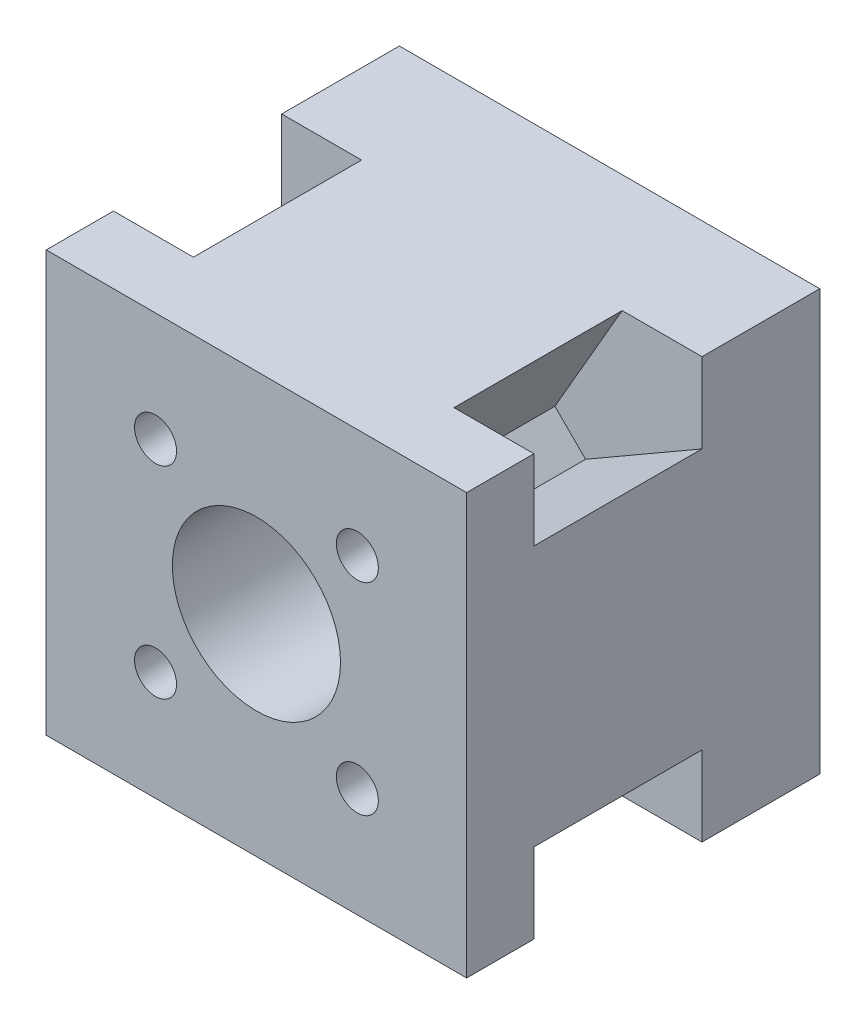
ISO-10303-21;
HEADER;
FILE_DESCRIPTION(('STEP AP214'),'2;1');
FILE_NAME('part.step','',(''),(''),'','','');
FILE_SCHEMA(('AUTOMOTIVE_DESIGN { 1 0 10303 214 1 1 1 1 }'));
ENDSEC;
DATA;
#1=APPLICATION_CONTEXT('core data for automotive mechanical design processes');
#2=APPLICATION_PROTOCOL_DEFINITION('international standard','automotive_design',2000,#1);
#3=PRODUCT_CONTEXT('',#1,'mechanical');
#4=PRODUCT('Part','Part','',(#3));
#5=PRODUCT_RELATED_PRODUCT_CATEGORY('part','',(#4));
#6=PRODUCT_DEFINITION_FORMATION('','',#4);
#7=PRODUCT_DEFINITION_CONTEXT('part definition',#1,'design');
#8=PRODUCT_DEFINITION('design','',#6,#7);
#9=PRODUCT_DEFINITION_SHAPE('','',#8);
#10=(LENGTH_UNIT() NAMED_UNIT(*) SI_UNIT(.MILLI.,.METRE.));
#11=(NAMED_UNIT(*) PLANE_ANGLE_UNIT() SI_UNIT($,.RADIAN.));
#12=(NAMED_UNIT(*) SI_UNIT($,.STERADIAN.) SOLID_ANGLE_UNIT());
#13=UNCERTAINTY_MEASURE_WITH_UNIT(LENGTH_MEASURE(1.E-05),#10,'distance_accuracy_value','');
#14=(GEOMETRIC_REPRESENTATION_CONTEXT(3) GLOBAL_UNCERTAINTY_ASSIGNED_CONTEXT((#13)) GLOBAL_UNIT_ASSIGNED_CONTEXT((#10,
#11,#12)) REPRESENTATION_CONTEXT('',''));
#15=CARTESIAN_POINT('',(0.,0.,0.));
#16=DIRECTION('',(0.,0.,1.));
#17=DIRECTION('',(1.,0.,0.));
#18=AXIS2_PLACEMENT_3D('',#15,#16,#17);
#19=CARTESIAN_POINT('',(0.,0.,14.));
#20=DIRECTION('',(0.,0.,1.));
#21=DIRECTION('',(1.,0.,0.));
#22=AXIS2_PLACEMENT_3D('',#19,#20,#21);
#23=PLANE('',#22);
#24=DIRECTION('',(0.500000000000004,0.866025403784436,0.));
#25=VECTOR('',#24,1.);
#26=CARTESIAN_POINT('',(7.49999999999993,11.143593539449,14.));
#27=LINE('',#26,#25);
#28=CARTESIAN_POINT('',(7.49999999999993,11.143593539449,14.));
#29=VERTEX_POINT('',#28);
#30=CARTESIAN_POINT('',(15.5,25.,14.));
#31=VERTEX_POINT('',#30);
#32=EDGE_CURVE('E51',#29,#31,#27,.T.);
#33=ORIENTED_EDGE('',*,*,#32,.F.);
#34=DIRECTION('',(-0.707106781186547,0.707106781186548,0.));
#35=VECTOR('',#34,1.);
#36=CARTESIAN_POINT('',(7.49999999999993,11.143593539449,14.));
#37=LINE('',#36,#35);
#38=CARTESIAN_POINT('',(11.143593539449,7.49999999999994,14.));
#39=VERTEX_POINT('',#38);
#40=EDGE_CURVE('E55',#39,#29,#37,.T.);
#41=ORIENTED_EDGE('',*,*,#40,.F.);
#42=DIRECTION('',(-0.866025403784436,-0.500000000000004,0.));
#43=VECTOR('',#42,1.);
#44=CARTESIAN_POINT('',(25.,15.5,14.));
#45=LINE('',#44,#43);
#46=CARTESIAN_POINT('',(25.,15.5,14.));
#47=VERTEX_POINT('',#46);
#48=EDGE_CURVE('E290',#47,#39,#45,.T.);
#49=ORIENTED_EDGE('',*,*,#48,.F.);
#50=DIRECTION('',(0.,-1.,0.));
#51=VECTOR('',#50,1.);
#52=CARTESIAN_POINT('',(25.,0.,14.));
#53=LINE('',#52,#51);
#54=CARTESIAN_POINT('',(25.,25.,14.));
#55=VERTEX_POINT('',#54);
#56=EDGE_CURVE('E366',#55,#47,#53,.T.);
#57=ORIENTED_EDGE('',*,*,#56,.F.);
#58=DIRECTION('',(1.,0.,0.));
#59=VECTOR('',#58,1.);
#60=CARTESIAN_POINT('',(0.,25.,14.));
#61=LINE('',#60,#59);
#62=EDGE_CURVE('E369',#31,#55,#61,.T.);
#63=ORIENTED_EDGE('',*,*,#62,.F.);
#64=EDGE_LOOP('',(#33,#41,#49,#57,#63));
#65=FACE_BOUND('',#64,.T.);
#66=ADVANCED_FACE('F36',(#65),#23,.T.);
#67=DIRECTION('',(0.866025403784439,-0.5,0.));
#68=VECTOR('',#67,1.);
#69=CARTESIAN_POINT('',(11.143593539449,-7.49999999999999,14.));
#70=LINE('',#69,#68);
#71=CARTESIAN_POINT('',(11.143593539449,-7.49999999999999,14.));
#72=VERTEX_POINT('',#71);
#73=CARTESIAN_POINT('',(25.,-15.5,14.));
#74=VERTEX_POINT('',#73);
#75=EDGE_CURVE('E287',#72,#74,#70,.T.);
#76=ORIENTED_EDGE('',*,*,#75,.F.);
#77=DIRECTION('',(0.70710678118655,0.707106781186545,0.));
#78=VECTOR('',#77,1.);
#79=CARTESIAN_POINT('',(7.49999999999993,-11.143593539449,14.));
#80=LINE('',#79,#78);
#81=CARTESIAN_POINT('',(7.49999999999993,-11.143593539449,14.));
#82=VERTEX_POINT('',#81);
#83=EDGE_CURVE('E284',#82,#72,#80,.T.);
#84=ORIENTED_EDGE('',*,*,#83,.F.);
#85=DIRECTION('',(-0.500000000000004,0.866025403784436,0.));
#86=VECTOR('',#85,1.);
#87=CARTESIAN_POINT('',(15.5,-25.,14.));
#88=LINE('',#87,#86);
#89=CARTESIAN_POINT('',(15.5,-25.,14.));
#90=VERTEX_POINT('',#89);
#91=EDGE_CURVE('E281',#90,#82,#88,.T.);
#92=ORIENTED_EDGE('',*,*,#91,.F.);
#93=DIRECTION('',(1.,0.,0.));
#94=VECTOR('',#93,1.);
#95=CARTESIAN_POINT('',(0.,-25.,14.));
#96=LINE('',#95,#94);
#97=CARTESIAN_POINT('',(25.,-25.,14.));
#98=VERTEX_POINT('',#97);
#99=EDGE_CURVE('E377',#90,#98,#96,.T.);
#100=ORIENTED_EDGE('',*,*,#99,.T.);
#101=EDGE_CURVE('E370',#74,#98,#53,.T.);
#102=ORIENTED_EDGE('',*,*,#101,.F.);
#103=EDGE_LOOP('',(#76,#84,#92,#100,#102));
#104=FACE_BOUND('',#103,.T.);
#105=ADVANCED_FACE('F513',(#104),#23,.T.);
#106=DIRECTION('',(-0.499999999999998,-0.86602540378444,0.));
#107=VECTOR('',#106,1.);
#108=CARTESIAN_POINT('',(-15.5,-25.,14.));
#109=LINE('',#108,#107);
#110=CARTESIAN_POINT('',(-7.50000000000004,-11.143593539449,14.));
#111=VERTEX_POINT('',#110);
#112=CARTESIAN_POINT('',(-15.5,-25.,14.));
#113=VERTEX_POINT('',#112);
#114=EDGE_CURVE('E278',#111,#113,#109,.T.);
#115=ORIENTED_EDGE('',*,*,#114,.F.);
#116=DIRECTION('',(0.707106781186544,-0.707106781186551,0.));
#117=VECTOR('',#116,1.);
#118=CARTESIAN_POINT('',(-11.143593539449,-7.49999999999993,14.));
#119=LINE('',#118,#117);
#120=CARTESIAN_POINT('',(-11.143593539449,-7.49999999999993,14.));
#121=VERTEX_POINT('',#120);
#122=EDGE_CURVE('E275',#121,#111,#119,.T.);
#123=ORIENTED_EDGE('',*,*,#122,.F.);
#124=DIRECTION('',(0.866025403784436,0.500000000000004,0.));
#125=VECTOR('',#124,1.);
#126=CARTESIAN_POINT('',(-25.,-15.5,14.));
#127=LINE('',#126,#125);
#128=CARTESIAN_POINT('',(-25.,-15.5,14.));
#129=VERTEX_POINT('',#128);
#130=EDGE_CURVE('E272',#129,#121,#127,.T.);
#131=ORIENTED_EDGE('',*,*,#130,.F.);
#132=DIRECTION('',(0.,-1.,0.));
#133=VECTOR('',#132,1.);
#134=CARTESIAN_POINT('',(-25.,0.,14.));
#135=LINE('',#134,#133);
#136=CARTESIAN_POINT('',(-25.,-25.,14.));
#137=VERTEX_POINT('',#136);
#138=EDGE_CURVE('E374',#129,#137,#135,.T.);
#139=ORIENTED_EDGE('',*,*,#138,.T.);
#140=EDGE_CURVE('E378',#137,#113,#96,.T.);
#141=ORIENTED_EDGE('',*,*,#140,.T.);
#142=EDGE_LOOP('',(#115,#123,#131,#139,#141));
#143=FACE_BOUND('',#142,.T.);
#144=ADVANCED_FACE('F515',(#143),#23,.T.);
#145=CARTESIAN_POINT('',(25.,0.,14.));
#146=DIRECTION('',(1.,0.,0.));
#147=DIRECTION('',(0.,1.,0.));
#148=AXIS2_PLACEMENT_3D('',#145,#146,#147);
#149=PLANE('',#148);
#150=DIRECTION('',(0.,-1.,0.));
#151=VECTOR('',#150,1.);
#152=CARTESIAN_POINT('',(25.,0.,0.));
#153=LINE('',#152,#151);
#154=CARTESIAN_POINT('',(25.,25.,0.));
#155=VERTEX_POINT('',#154);
#156=CARTESIAN_POINT('',(25.,-25.,0.));
#157=VERTEX_POINT('',#156);
#158=EDGE_CURVE('E363',#155,#157,#153,.T.);
#159=ORIENTED_EDGE('',*,*,#158,.F.);
#160=DIRECTION('',(0.,0.,-1.));
#161=VECTOR('',#160,1.);
#162=CARTESIAN_POINT('',(25.,25.,14.));
#163=LINE('',#162,#161);
#164=EDGE_CURVE('E11',#55,#155,#163,.T.);
#165=ORIENTED_EDGE('',*,*,#164,.F.);
#166=ORIENTED_EDGE('',*,*,#56,.T.);
#167=DIRECTION('',(0.,0.,-1.));
#168=VECTOR('',#167,1.);
#169=CARTESIAN_POINT('',(25.,15.5,34.));
#170=LINE('',#169,#168);
#171=CARTESIAN_POINT('',(25.,15.5,34.));
#172=VERTEX_POINT('',#171);
#173=EDGE_CURVE('E305',#172,#47,#170,.T.);
#174=ORIENTED_EDGE('',*,*,#173,.F.);
#175=DIRECTION('',(0.,1.,0.));
#176=VECTOR('',#175,1.);
#177=CARTESIAN_POINT('',(25.,25.,34.));
#178=LINE('',#177,#176);
#179=CARTESIAN_POINT('',(25.,25.,34.));
#180=VERTEX_POINT('',#179);
#181=EDGE_CURVE('E219',#172,#180,#178,.T.);
#182=ORIENTED_EDGE('',*,*,#181,.T.);
#183=DIRECTION('',(0.,0.,-1.));
#184=VECTOR('',#183,1.);
#185=CARTESIAN_POINT('',(25.,25.,42.));
#186=LINE('',#185,#184);
#187=CARTESIAN_POINT('',(25.,25.,42.));
#188=VERTEX_POINT('',#187);
#189=EDGE_CURVE('E200',#188,#180,#186,.T.);
#190=ORIENTED_EDGE('',*,*,#189,.F.);
#191=DIRECTION('',(0.,1.,0.));
#192=VECTOR('',#191,1.);
#193=CARTESIAN_POINT('',(25.,25.,42.));
#194=LINE('',#193,#192);
#195=CARTESIAN_POINT('',(25.,-25.,42.));
#196=VERTEX_POINT('',#195);
#197=EDGE_CURVE('E206',#196,#188,#194,.T.);
#198=ORIENTED_EDGE('',*,*,#197,.F.);
#199=DIRECTION('',(0.,0.,-1.));
#200=VECTOR('',#199,1.);
#201=CARTESIAN_POINT('',(25.,-25.,42.));
#202=LINE('',#201,#200);
#203=CARTESIAN_POINT('',(25.,-25.,34.));
#204=VERTEX_POINT('',#203);
#205=EDGE_CURVE('E435',#196,#204,#202,.T.);
#206=ORIENTED_EDGE('',*,*,#205,.T.);
#207=CARTESIAN_POINT('',(25.,-15.5,34.));
#208=VERTEX_POINT('',#207);
#209=EDGE_CURVE('E439',#204,#208,#178,.T.);
#210=ORIENTED_EDGE('',*,*,#209,.T.);
#211=DIRECTION('',(0.,0.,-1.));
#212=VECTOR('',#211,1.);
#213=CARTESIAN_POINT('',(25.,-15.5,34.));
#214=LINE('',#213,#212);
#215=EDGE_CURVE('E308',#208,#74,#214,.T.);
#216=ORIENTED_EDGE('',*,*,#215,.T.);
#217=ORIENTED_EDGE('',*,*,#101,.T.);
#218=DIRECTION('',(0.,0.,-1.));
#219=VECTOR('',#218,1.);
#220=CARTESIAN_POINT('',(25.,-25.,14.));
#221=LINE('',#220,#219);
#222=EDGE_CURVE('E380',#98,#157,#221,.T.);
#223=ORIENTED_EDGE('',*,*,#222,.T.);
#224=EDGE_LOOP('',(#159,#165,#166,#174,#182,#190,#198,#206,#210,#216,#217,#223));
#225=FACE_BOUND('',#224,.T.);
#226=ADVANCED_FACE('F38',(#225),#149,.T.);
#227=CARTESIAN_POINT('',(0.,25.,14.));
#228=DIRECTION('',(0.,1.,0.));
#229=DIRECTION('',(0.,0.,1.));
#230=AXIS2_PLACEMENT_3D('',#227,#228,#229);
#231=PLANE('',#230);
#232=DIRECTION('',(1.,0.,0.));
#233=VECTOR('',#232,1.);
#234=CARTESIAN_POINT('',(0.,25.,0.));
#235=LINE('',#234,#233);
#236=CARTESIAN_POINT('',(-25.,25.,0.));
#237=VERTEX_POINT('',#236);
#238=EDGE_CURVE('E383',#237,#155,#235,.T.);
#239=ORIENTED_EDGE('',*,*,#238,.F.);
#240=DIRECTION('',(0.,0.,-1.));
#241=VECTOR('',#240,1.);
#242=CARTESIAN_POINT('',(-25.,25.,14.));
#243=LINE('',#242,#241);
#244=CARTESIAN_POINT('',(-25.,25.,14.));
#245=VERTEX_POINT('',#244);
#246=EDGE_CURVE('E44',#245,#237,#243,.T.);
#247=ORIENTED_EDGE('',*,*,#246,.F.);
#248=CARTESIAN_POINT('',(-15.5,25.,14.));
#249=VERTEX_POINT('',#248);
#250=EDGE_CURVE('E371',#245,#249,#61,.T.);
#251=ORIENTED_EDGE('',*,*,#250,.T.);
#252=DIRECTION('',(0.,0.,-1.));
#253=VECTOR('',#252,1.);
#254=CARTESIAN_POINT('',(-15.5,25.,34.));
#255=LINE('',#254,#253);
#256=CARTESIAN_POINT('',(-15.5,25.,34.));
#257=VERTEX_POINT('',#256);
#258=EDGE_CURVE('E265',#257,#249,#255,.T.);
#259=ORIENTED_EDGE('',*,*,#258,.F.);
#260=DIRECTION('',(-1.,0.,0.));
#261=VECTOR('',#260,1.);
#262=CARTESIAN_POINT('',(-25.,25.,34.));
#263=LINE('',#262,#261);
#264=CARTESIAN_POINT('',(-25.,25.,34.));
#265=VERTEX_POINT('',#264);
#266=EDGE_CURVE('E430',#257,#265,#263,.T.);
#267=ORIENTED_EDGE('',*,*,#266,.T.);
#268=DIRECTION('',(0.,0.,-1.));
#269=VECTOR('',#268,1.);
#270=CARTESIAN_POINT('',(-25.,25.,42.));
#271=LINE('',#270,#269);
#272=CARTESIAN_POINT('',(-25.,25.,42.));
#273=VERTEX_POINT('',#272);
#274=EDGE_CURVE('E202',#273,#265,#271,.T.);
#275=ORIENTED_EDGE('',*,*,#274,.F.);
#276=DIRECTION('',(-1.,0.,0.));
#277=VECTOR('',#276,1.);
#278=CARTESIAN_POINT('',(-25.,25.,42.));
#279=LINE('',#278,#277);
#280=EDGE_CURVE('E194',#188,#273,#279,.T.);
#281=ORIENTED_EDGE('',*,*,#280,.F.);
#282=ORIENTED_EDGE('',*,*,#189,.T.);
#283=CARTESIAN_POINT('',(15.5,25.,34.));
#284=VERTEX_POINT('',#283);
#285=EDGE_CURVE('E426',#180,#284,#263,.T.);
#286=ORIENTED_EDGE('',*,*,#285,.T.);
#287=DIRECTION('',(0.,0.,-1.));
#288=VECTOR('',#287,1.);
#289=CARTESIAN_POINT('',(15.5,25.,34.));
#290=LINE('',#289,#288);
#291=EDGE_CURVE('E296',#284,#31,#290,.T.);
#292=ORIENTED_EDGE('',*,*,#291,.T.);
#293=ORIENTED_EDGE('',*,*,#62,.T.);
#294=ORIENTED_EDGE('',*,*,#164,.T.);
#295=EDGE_LOOP('',(#239,#247,#251,#259,#267,#275,#281,#282,#286,#292,#293,#294));
#296=FACE_BOUND('',#295,.T.);
#297=ADVANCED_FACE('F197',(#296),#231,.T.);
#298=CARTESIAN_POINT('',(-25.,0.,14.));
#299=DIRECTION('',(1.,0.,0.));
#300=DIRECTION('',(0.,1.,0.));
#301=AXIS2_PLACEMENT_3D('',#298,#299,#300);
#302=PLANE('',#301);
#303=DIRECTION('',(0.,-1.,0.));
#304=VECTOR('',#303,1.);
#305=CARTESIAN_POINT('',(-25.,0.,0.));
#306=LINE('',#305,#304);
#307=CARTESIAN_POINT('',(-25.,-25.,0.));
#308=VERTEX_POINT('',#307);
#309=EDGE_CURVE('E386',#237,#308,#306,.T.);
#310=ORIENTED_EDGE('',*,*,#309,.T.);
#311=DIRECTION('',(0.,0.,-1.));
#312=VECTOR('',#311,1.);
#313=CARTESIAN_POINT('',(-25.,-25.,14.));
#314=LINE('',#313,#312);
#315=EDGE_CURVE('E392',#137,#308,#314,.T.);
#316=ORIENTED_EDGE('',*,*,#315,.F.);
#317=ORIENTED_EDGE('',*,*,#138,.F.);
#318=DIRECTION('',(0.,0.,-1.));
#319=VECTOR('',#318,1.);
#320=CARTESIAN_POINT('',(-25.,-15.5,34.));
#321=LINE('',#320,#319);
#322=CARTESIAN_POINT('',(-25.,-15.5,34.));
#323=VERTEX_POINT('',#322);
#324=EDGE_CURVE('E329',#323,#129,#321,.T.);
#325=ORIENTED_EDGE('',*,*,#324,.F.);
#326=DIRECTION('',(0.,-1.,0.));
#327=VECTOR('',#326,1.);
#328=CARTESIAN_POINT('',(-25.,25.,34.));
#329=LINE('',#328,#327);
#330=CARTESIAN_POINT('',(-25.,-25.,34.));
#331=VERTEX_POINT('',#330);
#332=EDGE_CURVE('E420',#323,#331,#329,.T.);
#333=ORIENTED_EDGE('',*,*,#332,.T.);
#334=DIRECTION('',(0.,0.,-1.));
#335=VECTOR('',#334,1.);
#336=CARTESIAN_POINT('',(-25.,-25.,42.));
#337=LINE('',#336,#335);
#338=CARTESIAN_POINT('',(-25.,-25.,42.));
#339=VERTEX_POINT('',#338);
#340=EDGE_CURVE('E226',#339,#331,#337,.T.);
#341=ORIENTED_EDGE('',*,*,#340,.F.);
#342=DIRECTION('',(0.,-1.,0.));
#343=VECTOR('',#342,1.);
#344=CARTESIAN_POINT('',(-25.,25.,42.));
#345=LINE('',#344,#343);
#346=EDGE_CURVE('E205',#273,#339,#345,.T.);
#347=ORIENTED_EDGE('',*,*,#346,.F.);
#348=ORIENTED_EDGE('',*,*,#274,.T.);
#349=CARTESIAN_POINT('',(-25.,15.5,34.));
#350=VERTEX_POINT('',#349);
#351=EDGE_CURVE('E425',#265,#350,#329,.T.);
#352=ORIENTED_EDGE('',*,*,#351,.T.);
#353=DIRECTION('',(0.,0.,-1.));
#354=VECTOR('',#353,1.);
#355=CARTESIAN_POINT('',(-25.,15.5,34.));
#356=LINE('',#355,#354);
#357=CARTESIAN_POINT('',(-25.,15.5,14.));
#358=VERTEX_POINT('',#357);
#359=EDGE_CURVE('E332',#350,#358,#356,.T.);
#360=ORIENTED_EDGE('',*,*,#359,.T.);
#361=EDGE_CURVE('E375',#245,#358,#135,.T.);
#362=ORIENTED_EDGE('',*,*,#361,.F.);
#363=ORIENTED_EDGE('',*,*,#246,.T.);
#364=EDGE_LOOP('',(#310,#316,#317,#325,#333,#341,#347,#348,#352,#360,#362,#363));
#365=FACE_BOUND('',#364,.T.);
#366=ADVANCED_FACE('F397',(#365),#302,.F.);
#367=CARTESIAN_POINT('',(0.,-25.,14.));
#368=DIRECTION('',(0.,1.,0.));
#369=DIRECTION('',(0.,0.,1.));
#370=AXIS2_PLACEMENT_3D('',#367,#368,#369);
#371=PLANE('',#370);
#372=DIRECTION('',(1.,0.,0.));
#373=VECTOR('',#372,1.);
#374=CARTESIAN_POINT('',(0.,-25.,0.));
#375=LINE('',#374,#373);
#376=EDGE_CURVE('E388',#308,#157,#375,.T.);
#377=ORIENTED_EDGE('',*,*,#376,.T.);
#378=ORIENTED_EDGE('',*,*,#222,.F.);
#379=ORIENTED_EDGE('',*,*,#99,.F.);
#380=DIRECTION('',(0.,0.,-1.));
#381=VECTOR('',#380,1.);
#382=CARTESIAN_POINT('',(15.5,-25.,34.));
#383=LINE('',#382,#381);
#384=CARTESIAN_POINT('',(15.5,-25.,34.));
#385=VERTEX_POINT('',#384);
#386=EDGE_CURVE('E317',#385,#90,#383,.T.);
#387=ORIENTED_EDGE('',*,*,#386,.F.);
#388=DIRECTION('',(1.,0.,0.));
#389=VECTOR('',#388,1.);
#390=CARTESIAN_POINT('',(-25.,-25.,34.));
#391=LINE('',#390,#389);
#392=EDGE_CURVE('E429',#385,#204,#391,.T.);
#393=ORIENTED_EDGE('',*,*,#392,.T.);
#394=ORIENTED_EDGE('',*,*,#205,.F.);
#395=DIRECTION('',(1.,0.,0.));
#396=VECTOR('',#395,1.);
#397=CARTESIAN_POINT('',(-25.,-25.,42.));
#398=LINE('',#397,#396);
#399=EDGE_CURVE('E211',#339,#196,#398,.T.);
#400=ORIENTED_EDGE('',*,*,#399,.F.);
#401=ORIENTED_EDGE('',*,*,#340,.T.);
#402=CARTESIAN_POINT('',(-15.5,-25.,34.));
#403=VERTEX_POINT('',#402);
#404=EDGE_CURVE('E215',#331,#403,#391,.T.);
#405=ORIENTED_EDGE('',*,*,#404,.T.);
#406=DIRECTION('',(0.,0.,-1.));
#407=VECTOR('',#406,1.);
#408=CARTESIAN_POINT('',(-15.5,-25.,34.));
#409=LINE('',#408,#407);
#410=EDGE_CURVE('E320',#403,#113,#409,.T.);
#411=ORIENTED_EDGE('',*,*,#410,.T.);
#412=ORIENTED_EDGE('',*,*,#140,.F.);
#413=ORIENTED_EDGE('',*,*,#315,.T.);
#414=EDGE_LOOP('',(#377,#378,#379,#387,#393,#394,#400,#401,#405,#411,#412,#413));
#415=FACE_BOUND('',#414,.T.);
#416=ADVANCED_FACE('F409',(#415),#371,.F.);
#417=DIRECTION('',(0.500000000000004,-0.866025403784436,0.));
#418=VECTOR('',#417,1.);
#419=CARTESIAN_POINT('',(-15.5,25.,14.));
#420=LINE('',#419,#418);
#421=CARTESIAN_POINT('',(-7.49999999999994,11.143593539449,14.));
#422=VERTEX_POINT('',#421);
#423=EDGE_CURVE('E221',#249,#422,#420,.T.);
#424=ORIENTED_EDGE('',*,*,#423,.F.);
#425=ORIENTED_EDGE('',*,*,#250,.F.);
#426=ORIENTED_EDGE('',*,*,#361,.T.);
#427=DIRECTION('',(-0.866025403784436,0.500000000000004,0.));
#428=VECTOR('',#427,1.);
#429=CARTESIAN_POINT('',(-11.143593539449,7.49999999999994,14.));
#430=LINE('',#429,#428);
#431=CARTESIAN_POINT('',(-11.143593539449,7.49999999999994,14.));
#432=VERTEX_POINT('',#431);
#433=EDGE_CURVE('E269',#432,#358,#430,.T.);
#434=ORIENTED_EDGE('',*,*,#433,.F.);
#435=DIRECTION('',(-0.707106781186548,-0.707106781186547,0.));
#436=VECTOR('',#435,1.);
#437=CARTESIAN_POINT('',(-7.49999999999994,11.143593539449,14.));
#438=LINE('',#437,#436);
#439=EDGE_CURVE('E224',#422,#432,#438,.T.);
#440=ORIENTED_EDGE('',*,*,#439,.F.);
#441=EDGE_LOOP('',(#424,#425,#426,#434,#440));
#442=FACE_BOUND('',#441,.T.);
#443=ADVANCED_FACE('F521',(#442),#23,.T.);
#444=CARTESIAN_POINT('',(0.,0.,0.));
#445=DIRECTION('',(0.,0.,1.));
#446=DIRECTION('',(1.,0.,0.));
#447=AXIS2_PLACEMENT_3D('',#444,#445,#446);
#448=PLANE('',#447);
#449=CARTESIAN_POINT('',(0.,0.,0.));
#450=DIRECTION('',(0.,0.,1.));
#451=DIRECTION('',(1.,0.,0.));
#452=AXIS2_PLACEMENT_3D('',#449,#450,#451);
#453=CIRCLE('',#452,9.99999999999999);
#454=CARTESIAN_POINT('',(9.99999999999999,0.,0.));
#455=VERTEX_POINT('',#454);
#456=EDGE_CURVE('E459',#455,#455,#453,.F.);
#457=ORIENTED_EDGE('',*,*,#456,.F.);
#458=EDGE_LOOP('',(#457));
#459=FACE_BOUND('',#458,.T.);
#460=CARTESIAN_POINT('',(16.5,-16.5,0.));
#461=DIRECTION('',(0.,0.,-1.));
#462=DIRECTION('',(-1.,0.,0.));
#463=AXIS2_PLACEMENT_3D('',#460,#461,#462);
#464=CIRCLE('',#463,2.75);
#465=CARTESIAN_POINT('',(13.75,-16.5,0.));
#466=VERTEX_POINT('',#465);
#467=EDGE_CURVE('E341',#466,#466,#464,.T.);
#468=ORIENTED_EDGE('',*,*,#467,.F.);
#469=EDGE_LOOP('',(#468));
#470=FACE_BOUND('',#469,.T.);
#471=CARTESIAN_POINT('',(-16.5,-16.5,0.));
#472=DIRECTION('',(0.,0.,-1.));
#473=DIRECTION('',(-1.,0.,0.));
#474=AXIS2_PLACEMENT_3D('',#471,#472,#473);
#475=CIRCLE('',#474,2.75);
#476=CARTESIAN_POINT('',(-19.25,-16.5,0.));
#477=VERTEX_POINT('',#476);
#478=EDGE_CURVE('E352',#477,#477,#475,.T.);
#479=ORIENTED_EDGE('',*,*,#478,.F.);
#480=EDGE_LOOP('',(#479));
#481=FACE_BOUND('',#480,.T.);
#482=CARTESIAN_POINT('',(-16.5,16.5,0.));
#483=DIRECTION('',(0.,0.,-1.));
#484=DIRECTION('',(-1.,0.,0.));
#485=AXIS2_PLACEMENT_3D('',#482,#483,#484);
#486=CIRCLE('',#485,2.75);
#487=CARTESIAN_POINT('',(-19.25,16.5,0.));
#488=VERTEX_POINT('',#487);
#489=EDGE_CURVE('E346',#488,#488,#486,.T.);
#490=ORIENTED_EDGE('',*,*,#489,.F.);
#491=EDGE_LOOP('',(#490));
#492=FACE_BOUND('',#491,.T.);
#493=CARTESIAN_POINT('',(16.5,16.5,0.));
#494=DIRECTION('',(0.,0.,-1.));
#495=DIRECTION('',(-1.,0.,0.));
#496=AXIS2_PLACEMENT_3D('',#493,#494,#495);
#497=CIRCLE('',#496,2.75);
#498=CARTESIAN_POINT('',(13.75,16.5,0.));
#499=VERTEX_POINT('',#498);
#500=EDGE_CURVE('E345',#499,#499,#497,.T.);
#501=ORIENTED_EDGE('',*,*,#500,.F.);
#502=EDGE_LOOP('',(#501));
#503=FACE_BOUND('',#502,.T.);
#504=ORIENTED_EDGE('',*,*,#158,.T.);
#505=ORIENTED_EDGE('',*,*,#376,.F.);
#506=ORIENTED_EDGE('',*,*,#309,.F.);
#507=ORIENTED_EDGE('',*,*,#238,.T.);
#508=EDGE_LOOP('',(#504,#505,#506,#507));
#509=FACE_BOUND('',#508,.T.);
#510=ADVANCED_FACE('F402',(#459,#470,#481,#492,#503,#509),#448,.F.);
#511=CARTESIAN_POINT('',(16.5,16.5,12.));
#512=DIRECTION('',(0.,0.,-1.));
#513=DIRECTION('',(-1.,0.,0.));
#514=AXIS2_PLACEMENT_3D('',#511,#512,#513);
#515=CYLINDRICAL_SURFACE('',#514,2.75);
#516=CARTESIAN_POINT('',(16.5,16.5,12.));
#517=DIRECTION('',(0.,0.,-1.));
#518=DIRECTION('',(-1.,0.,0.));
#519=AXIS2_PLACEMENT_3D('',#516,#517,#518);
#520=CIRCLE('',#519,2.75);
#521=CARTESIAN_POINT('',(13.75,16.5,12.));
#522=VERTEX_POINT('',#521);
#523=EDGE_CURVE('E360',#522,#522,#520,.T.);
#524=ORIENTED_EDGE('',*,*,#523,.F.);
#525=EDGE_LOOP('',(#524));
#526=FACE_BOUND('',#525,.T.);
#527=ORIENTED_EDGE('',*,*,#500,.T.);
#528=EDGE_LOOP('',(#527));
#529=FACE_BOUND('',#528,.T.);
#530=ADVANCED_FACE('F526',(#526,#529),#515,.F.);
#531=CARTESIAN_POINT('',(16.5,16.5,12.));
#532=DIRECTION('',(0.,0.,-1.));
#533=DIRECTION('',(-1.,0.,0.));
#534=AXIS2_PLACEMENT_3D('',#531,#532,#533);
#535=PLANE('',#534);
#536=ORIENTED_EDGE('',*,*,#523,.T.);
#537=EDGE_LOOP('',(#536));
#538=FACE_BOUND('',#537,.T.);
#539=ADVANCED_FACE('F571',(#538),#535,.T.);
#540=CARTESIAN_POINT('',(-16.5,16.5,12.));
#541=DIRECTION('',(0.,0.,-1.));
#542=DIRECTION('',(-1.,0.,0.));
#543=AXIS2_PLACEMENT_3D('',#540,#541,#542);
#544=CYLINDRICAL_SURFACE('',#543,2.75);
#545=CARTESIAN_POINT('',(-16.5,16.5,12.));
#546=DIRECTION('',(0.,0.,-1.));
#547=DIRECTION('',(-1.,0.,0.));
#548=AXIS2_PLACEMENT_3D('',#545,#546,#547);
#549=CIRCLE('',#548,2.75);
#550=CARTESIAN_POINT('',(-19.25,16.5,12.));
#551=VERTEX_POINT('',#550);
#552=EDGE_CURVE('E342',#551,#551,#549,.T.);
#553=ORIENTED_EDGE('',*,*,#552,.F.);
#554=EDGE_LOOP('',(#553));
#555=FACE_BOUND('',#554,.T.);
#556=ORIENTED_EDGE('',*,*,#489,.T.);
#557=EDGE_LOOP('',(#556));
#558=FACE_BOUND('',#557,.T.);
#559=ADVANCED_FACE('F578',(#555,#558),#544,.F.);
#560=CARTESIAN_POINT('',(-16.5,16.5,12.));
#561=DIRECTION('',(0.,0.,-1.));
#562=DIRECTION('',(-1.,0.,0.));
#563=AXIS2_PLACEMENT_3D('',#560,#561,#562);
#564=PLANE('',#563);
#565=ORIENTED_EDGE('',*,*,#552,.T.);
#566=EDGE_LOOP('',(#565));
#567=FACE_BOUND('',#566,.T.);
#568=ADVANCED_FACE('F585',(#567),#564,.T.);
#569=CARTESIAN_POINT('',(-16.5,-16.5,12.));
#570=DIRECTION('',(0.,0.,-1.));
#571=DIRECTION('',(-1.,0.,0.));
#572=AXIS2_PLACEMENT_3D('',#569,#570,#571);
#573=CYLINDRICAL_SURFACE('',#572,2.75);
#574=CARTESIAN_POINT('',(-16.5,-16.5,12.));
#575=DIRECTION('',(0.,0.,-1.));
#576=DIRECTION('',(-1.,0.,0.));
#577=AXIS2_PLACEMENT_3D('',#574,#575,#576);
#578=CIRCLE('',#577,2.75);
#579=CARTESIAN_POINT('',(-19.25,-16.5,12.));
#580=VERTEX_POINT('',#579);
#581=EDGE_CURVE('E349',#580,#580,#578,.T.);
#582=ORIENTED_EDGE('',*,*,#581,.F.);
#583=EDGE_LOOP('',(#582));
#584=FACE_BOUND('',#583,.T.);
#585=ORIENTED_EDGE('',*,*,#478,.T.);
#586=EDGE_LOOP('',(#585));
#587=FACE_BOUND('',#586,.T.);
#588=ADVANCED_FACE('F593',(#584,#587),#573,.F.);
#589=CARTESIAN_POINT('',(-16.5,-16.5,12.));
#590=DIRECTION('',(0.,0.,-1.));
#591=DIRECTION('',(-1.,0.,0.));
#592=AXIS2_PLACEMENT_3D('',#589,#590,#591);
#593=PLANE('',#592);
#594=ORIENTED_EDGE('',*,*,#581,.T.);
#595=EDGE_LOOP('',(#594));
#596=FACE_BOUND('',#595,.T.);
#597=ADVANCED_FACE('F601',(#596),#593,.T.);
#598=CARTESIAN_POINT('',(16.5,-16.5,12.));
#599=DIRECTION('',(0.,0.,-1.));
#600=DIRECTION('',(-1.,0.,0.));
#601=AXIS2_PLACEMENT_3D('',#598,#599,#600);
#602=CYLINDRICAL_SURFACE('',#601,2.75);
#603=CARTESIAN_POINT('',(16.5,-16.5,12.));
#604=DIRECTION('',(0.,0.,-1.));
#605=DIRECTION('',(-1.,0.,0.));
#606=AXIS2_PLACEMENT_3D('',#603,#604,#605);
#607=CIRCLE('',#606,2.75);
#608=CARTESIAN_POINT('',(13.75,-16.5,12.));
#609=VERTEX_POINT('',#608);
#610=EDGE_CURVE('E355',#609,#609,#607,.T.);
#611=ORIENTED_EDGE('',*,*,#610,.F.);
#612=EDGE_LOOP('',(#611));
#613=FACE_BOUND('',#612,.T.);
#614=ORIENTED_EDGE('',*,*,#467,.T.);
#615=EDGE_LOOP('',(#614));
#616=FACE_BOUND('',#615,.T.);
#617=ADVANCED_FACE('F609',(#613,#616),#602,.F.);
#618=CARTESIAN_POINT('',(16.5,-16.5,12.));
#619=DIRECTION('',(0.,0.,-1.));
#620=DIRECTION('',(-1.,0.,0.));
#621=AXIS2_PLACEMENT_3D('',#618,#619,#620);
#622=PLANE('',#621);
#623=ORIENTED_EDGE('',*,*,#610,.T.);
#624=EDGE_LOOP('',(#623));
#625=FACE_BOUND('',#624,.T.);
#626=ADVANCED_FACE('F617',(#625),#622,.T.);
#627=CARTESIAN_POINT('',(-15.5,25.,34.));
#628=DIRECTION('',(0.866025403784436,0.500000000000004,0.));
#629=DIRECTION('',(-0.500000000000004,0.866025403784436,0.));
#630=AXIS2_PLACEMENT_3D('',#627,#628,#629);
#631=PLANE('',#630);
#632=ORIENTED_EDGE('',*,*,#423,.T.);
#633=DIRECTION('',(0.,0.,-1.));
#634=VECTOR('',#633,1.);
#635=CARTESIAN_POINT('',(-7.49999999999994,11.143593539449,34.));
#636=LINE('',#635,#634);
#637=CARTESIAN_POINT('',(-7.49999999999994,11.143593539449,34.));
#638=VERTEX_POINT('',#637);
#639=EDGE_CURVE('E338',#638,#422,#636,.T.);
#640=ORIENTED_EDGE('',*,*,#639,.F.);
#641=DIRECTION('',(0.500000000000004,-0.866025403784436,0.));
#642=VECTOR('',#641,1.);
#643=CARTESIAN_POINT('',(-15.5,25.,34.));
#644=LINE('',#643,#642);
#645=EDGE_CURVE('E230',#257,#638,#644,.T.);
#646=ORIENTED_EDGE('',*,*,#645,.F.);
#647=ORIENTED_EDGE('',*,*,#258,.T.);
#648=EDGE_LOOP('',(#632,#640,#646,#647));
#649=FACE_BOUND('',#648,.T.);
#650=ADVANCED_FACE('F625',(#649),#631,.F.);
#651=CARTESIAN_POINT('',(-7.49999999999994,11.143593539449,34.));
#652=DIRECTION('',(0.707106781186547,-0.707106781186548,0.));
#653=DIRECTION('',(0.707106781186548,0.707106781186547,0.));
#654=AXIS2_PLACEMENT_3D('',#651,#652,#653);
#655=PLANE('',#654);
#656=ORIENTED_EDGE('',*,*,#439,.T.);
#657=DIRECTION('',(0.,0.,-1.));
#658=VECTOR('',#657,1.);
#659=CARTESIAN_POINT('',(-11.143593539449,7.49999999999994,34.));
#660=LINE('',#659,#658);
#661=CARTESIAN_POINT('',(-11.143593539449,7.49999999999994,34.));
#662=VERTEX_POINT('',#661);
#663=EDGE_CURVE('E335',#662,#432,#660,.T.);
#664=ORIENTED_EDGE('',*,*,#663,.F.);
#665=DIRECTION('',(-0.707106781186548,-0.707106781186547,0.));
#666=VECTOR('',#665,1.);
#667=CARTESIAN_POINT('',(-7.49999999999994,11.143593539449,34.));
#668=LINE('',#667,#666);
#669=EDGE_CURVE('E233',#638,#662,#668,.T.);
#670=ORIENTED_EDGE('',*,*,#669,.F.);
#671=ORIENTED_EDGE('',*,*,#639,.T.);
#672=EDGE_LOOP('',(#656,#664,#670,#671));
#673=FACE_BOUND('',#672,.T.);
#674=ADVANCED_FACE('F632',(#673),#655,.F.);
#675=CARTESIAN_POINT('',(-11.143593539449,7.49999999999994,34.));
#676=DIRECTION('',(-0.500000000000004,-0.866025403784436,0.));
#677=DIRECTION('',(0.866025403784436,-0.500000000000004,0.));
#678=AXIS2_PLACEMENT_3D('',#675,#676,#677);
#679=PLANE('',#678);
#680=ORIENTED_EDGE('',*,*,#433,.T.);
#681=ORIENTED_EDGE('',*,*,#359,.F.);
#682=DIRECTION('',(-0.866025403784436,0.500000000000004,0.));
#683=VECTOR('',#682,1.);
#684=CARTESIAN_POINT('',(-11.143593539449,7.49999999999994,34.));
#685=LINE('',#684,#683);
#686=EDGE_CURVE('E236',#662,#350,#685,.T.);
#687=ORIENTED_EDGE('',*,*,#686,.F.);
#688=ORIENTED_EDGE('',*,*,#663,.T.);
#689=EDGE_LOOP('',(#680,#681,#687,#688));
#690=FACE_BOUND('',#689,.T.);
#691=ADVANCED_FACE('F640',(#690),#679,.F.);
#692=CARTESIAN_POINT('',(-25.,-15.5,34.));
#693=DIRECTION('',(-0.500000000000004,0.866025403784436,0.));
#694=DIRECTION('',(-0.866025403784436,-0.500000000000004,0.));
#695=AXIS2_PLACEMENT_3D('',#692,#693,#694);
#696=PLANE('',#695);
#697=ORIENTED_EDGE('',*,*,#130,.T.);
#698=DIRECTION('',(0.,0.,-1.));
#699=VECTOR('',#698,1.);
#700=CARTESIAN_POINT('',(-11.143593539449,-7.49999999999993,34.));
#701=LINE('',#700,#699);
#702=CARTESIAN_POINT('',(-11.143593539449,-7.49999999999993,34.));
#703=VERTEX_POINT('',#702);
#704=EDGE_CURVE('E326',#703,#121,#701,.T.);
#705=ORIENTED_EDGE('',*,*,#704,.F.);
#706=DIRECTION('',(0.866025403784436,0.500000000000004,0.));
#707=VECTOR('',#706,1.);
#708=CARTESIAN_POINT('',(-25.,-15.5,34.));
#709=LINE('',#708,#707);
#710=EDGE_CURVE('E239',#323,#703,#709,.T.);
#711=ORIENTED_EDGE('',*,*,#710,.F.);
#712=ORIENTED_EDGE('',*,*,#324,.T.);
#713=EDGE_LOOP('',(#697,#705,#711,#712));
#714=FACE_BOUND('',#713,.T.);
#715=ADVANCED_FACE('F415',(#714),#696,.F.);
#716=CARTESIAN_POINT('',(-11.143593539449,-7.49999999999993,34.));
#717=DIRECTION('',(0.707106781186551,0.707106781186544,0.));
#718=DIRECTION('',(-0.707106781186544,0.707106781186551,0.));
#719=AXIS2_PLACEMENT_3D('',#716,#717,#718);
#720=PLANE('',#719);
#721=ORIENTED_EDGE('',*,*,#122,.T.);
#722=DIRECTION('',(0.,0.,-1.));
#723=VECTOR('',#722,1.);
#724=CARTESIAN_POINT('',(-7.50000000000004,-11.143593539449,34.));
#725=LINE('',#724,#723);
#726=CARTESIAN_POINT('',(-7.50000000000004,-11.143593539449,34.));
#727=VERTEX_POINT('',#726);
#728=EDGE_CURVE('E323',#727,#111,#725,.T.);
#729=ORIENTED_EDGE('',*,*,#728,.F.);
#730=DIRECTION('',(0.707106781186544,-0.707106781186551,0.));
#731=VECTOR('',#730,1.);
#732=CARTESIAN_POINT('',(-11.143593539449,-7.49999999999993,34.));
#733=LINE('',#732,#731);
#734=EDGE_CURVE('E242',#703,#727,#733,.T.);
#735=ORIENTED_EDGE('',*,*,#734,.F.);
#736=ORIENTED_EDGE('',*,*,#704,.T.);
#737=EDGE_LOOP('',(#721,#729,#735,#736));
#738=FACE_BOUND('',#737,.T.);
#739=ADVANCED_FACE('F655',(#738),#720,.F.);
#740=CARTESIAN_POINT('',(-15.5,-25.,34.));
#741=DIRECTION('',(0.86602540378444,-0.499999999999998,0.));
#742=DIRECTION('',(0.499999999999998,0.86602540378444,0.));
#743=AXIS2_PLACEMENT_3D('',#740,#741,#742);
#744=PLANE('',#743);
#745=ORIENTED_EDGE('',*,*,#114,.T.);
#746=ORIENTED_EDGE('',*,*,#410,.F.);
#747=DIRECTION('',(-0.499999999999998,-0.86602540378444,0.));
#748=VECTOR('',#747,1.);
#749=CARTESIAN_POINT('',(-15.5,-25.,34.));
#750=LINE('',#749,#748);
#751=EDGE_CURVE('E245',#727,#403,#750,.T.);
#752=ORIENTED_EDGE('',*,*,#751,.F.);
#753=ORIENTED_EDGE('',*,*,#728,.T.);
#754=EDGE_LOOP('',(#745,#746,#752,#753));
#755=FACE_BOUND('',#754,.T.);
#756=ADVANCED_FACE('F662',(#755),#744,.F.);
#757=CARTESIAN_POINT('',(15.5,-25.,34.));
#758=DIRECTION('',(-0.866025403784436,-0.500000000000004,0.));
#759=DIRECTION('',(0.500000000000004,-0.866025403784436,0.));
#760=AXIS2_PLACEMENT_3D('',#757,#758,#759);
#761=PLANE('',#760);
#762=ORIENTED_EDGE('',*,*,#91,.T.);
#763=DIRECTION('',(0.,0.,-1.));
#764=VECTOR('',#763,1.);
#765=CARTESIAN_POINT('',(7.49999999999993,-11.143593539449,34.));
#766=LINE('',#765,#764);
#767=CARTESIAN_POINT('',(7.49999999999993,-11.143593539449,34.));
#768=VERTEX_POINT('',#767);
#769=EDGE_CURVE('E314',#768,#82,#766,.T.);
#770=ORIENTED_EDGE('',*,*,#769,.F.);
#771=DIRECTION('',(-0.500000000000004,0.866025403784436,0.));
#772=VECTOR('',#771,1.);
#773=CARTESIAN_POINT('',(15.5,-25.,34.));
#774=LINE('',#773,#772);
#775=EDGE_CURVE('E248',#385,#768,#774,.T.);
#776=ORIENTED_EDGE('',*,*,#775,.F.);
#777=ORIENTED_EDGE('',*,*,#386,.T.);
#778=EDGE_LOOP('',(#762,#770,#776,#777));
#779=FACE_BOUND('',#778,.T.);
#780=ADVANCED_FACE('F505',(#779),#761,.F.);
#781=CARTESIAN_POINT('',(7.49999999999993,-11.143593539449,34.));
#782=DIRECTION('',(-0.707106781186545,0.70710678118655,0.));
#783=DIRECTION('',(-0.70710678118655,-0.707106781186545,0.));
#784=AXIS2_PLACEMENT_3D('',#781,#782,#783);
#785=PLANE('',#784);
#786=ORIENTED_EDGE('',*,*,#83,.T.);
#787=DIRECTION('',(0.,0.,-1.));
#788=VECTOR('',#787,1.);
#789=CARTESIAN_POINT('',(11.143593539449,-7.49999999999999,34.));
#790=LINE('',#789,#788);
#791=CARTESIAN_POINT('',(11.143593539449,-7.49999999999999,34.));
#792=VERTEX_POINT('',#791);
#793=EDGE_CURVE('E311',#792,#72,#790,.T.);
#794=ORIENTED_EDGE('',*,*,#793,.F.);
#795=DIRECTION('',(0.70710678118655,0.707106781186545,0.));
#796=VECTOR('',#795,1.);
#797=CARTESIAN_POINT('',(7.49999999999993,-11.143593539449,34.));
#798=LINE('',#797,#796);
#799=EDGE_CURVE('E251',#768,#792,#798,.T.);
#800=ORIENTED_EDGE('',*,*,#799,.F.);
#801=ORIENTED_EDGE('',*,*,#769,.T.);
#802=EDGE_LOOP('',(#786,#794,#800,#801));
#803=FACE_BOUND('',#802,.T.);
#804=ADVANCED_FACE('F508',(#803),#785,.F.);
#805=CARTESIAN_POINT('',(11.143593539449,-7.49999999999999,34.));
#806=DIRECTION('',(0.5,0.866025403784439,0.));
#807=DIRECTION('',(-0.866025403784439,0.5,0.));
#808=AXIS2_PLACEMENT_3D('',#805,#806,#807);
#809=PLANE('',#808);
#810=ORIENTED_EDGE('',*,*,#75,.T.);
#811=ORIENTED_EDGE('',*,*,#215,.F.);
#812=DIRECTION('',(0.866025403784439,-0.5,0.));
#813=VECTOR('',#812,1.);
#814=CARTESIAN_POINT('',(11.143593539449,-7.49999999999999,34.));
#815=LINE('',#814,#813);
#816=EDGE_CURVE('E254',#792,#208,#815,.T.);
#817=ORIENTED_EDGE('',*,*,#816,.F.);
#818=ORIENTED_EDGE('',*,*,#793,.T.);
#819=EDGE_LOOP('',(#810,#811,#817,#818));
#820=FACE_BOUND('',#819,.T.);
#821=ADVANCED_FACE('F511',(#820),#809,.F.);
#822=CARTESIAN_POINT('',(25.,15.5,34.));
#823=DIRECTION('',(0.500000000000004,-0.866025403784436,0.));
#824=DIRECTION('',(0.866025403784436,0.500000000000004,0.));
#825=AXIS2_PLACEMENT_3D('',#822,#823,#824);
#826=PLANE('',#825);
#827=ORIENTED_EDGE('',*,*,#48,.T.);
#828=DIRECTION('',(0.,0.,-1.));
#829=VECTOR('',#828,1.);
#830=CARTESIAN_POINT('',(11.143593539449,7.49999999999994,34.));
#831=LINE('',#830,#829);
#832=CARTESIAN_POINT('',(11.143593539449,7.49999999999994,34.));
#833=VERTEX_POINT('',#832);
#834=EDGE_CURVE('E302',#833,#39,#831,.T.);
#835=ORIENTED_EDGE('',*,*,#834,.F.);
#836=DIRECTION('',(-0.866025403784436,-0.500000000000004,0.));
#837=VECTOR('',#836,1.);
#838=CARTESIAN_POINT('',(25.,15.5,34.));
#839=LINE('',#838,#837);
#840=EDGE_CURVE('E257',#172,#833,#839,.T.);
#841=ORIENTED_EDGE('',*,*,#840,.F.);
#842=ORIENTED_EDGE('',*,*,#173,.T.);
#843=EDGE_LOOP('',(#827,#835,#841,#842));
#844=FACE_BOUND('',#843,.T.);
#845=ADVANCED_FACE('F689',(#844),#826,.F.);
#846=CARTESIAN_POINT('',(7.49999999999993,11.143593539449,34.));
#847=DIRECTION('',(-0.707106781186548,-0.707106781186547,0.));
#848=DIRECTION('',(0.707106781186547,-0.707106781186548,0.));
#849=AXIS2_PLACEMENT_3D('',#846,#847,#848);
#850=PLANE('',#849);
#851=ORIENTED_EDGE('',*,*,#40,.T.);
#852=DIRECTION('',(0.,0.,-1.));
#853=VECTOR('',#852,1.);
#854=CARTESIAN_POINT('',(7.49999999999993,11.143593539449,34.));
#855=LINE('',#854,#853);
#856=CARTESIAN_POINT('',(7.49999999999993,11.143593539449,34.));
#857=VERTEX_POINT('',#856);
#858=EDGE_CURVE('E299',#857,#29,#855,.T.);
#859=ORIENTED_EDGE('',*,*,#858,.F.);
#860=DIRECTION('',(-0.707106781186547,0.707106781186548,0.));
#861=VECTOR('',#860,1.);
#862=CARTESIAN_POINT('',(7.49999999999993,11.143593539449,34.));
#863=LINE('',#862,#861);
#864=EDGE_CURVE('E260',#833,#857,#863,.T.);
#865=ORIENTED_EDGE('',*,*,#864,.F.);
#866=ORIENTED_EDGE('',*,*,#834,.T.);
#867=EDGE_LOOP('',(#851,#859,#865,#866));
#868=FACE_BOUND('',#867,.T.);
#869=ADVANCED_FACE('F696',(#868),#850,.F.);
#870=CARTESIAN_POINT('',(7.49999999999993,11.143593539449,34.));
#871=DIRECTION('',(-0.866025403784436,0.500000000000004,0.));
#872=DIRECTION('',(-0.500000000000004,-0.866025403784436,0.));
#873=AXIS2_PLACEMENT_3D('',#870,#871,#872);
#874=PLANE('',#873);
#875=ORIENTED_EDGE('',*,*,#32,.T.);
#876=ORIENTED_EDGE('',*,*,#291,.F.);
#877=DIRECTION('',(0.500000000000004,0.866025403784436,0.));
#878=VECTOR('',#877,1.);
#879=CARTESIAN_POINT('',(7.49999999999993,11.143593539449,34.));
#880=LINE('',#879,#878);
#881=EDGE_CURVE('E263',#857,#284,#880,.T.);
#882=ORIENTED_EDGE('',*,*,#881,.F.);
#883=ORIENTED_EDGE('',*,*,#858,.T.);
#884=EDGE_LOOP('',(#875,#876,#882,#883));
#885=FACE_BOUND('',#884,.T.);
#886=ADVANCED_FACE('F704',(#885),#874,.F.);
#887=CARTESIAN_POINT('',(0.,0.,34.));
#888=DIRECTION('',(0.,0.,1.));
#889=DIRECTION('',(1.,0.,0.));
#890=AXIS2_PLACEMENT_3D('',#887,#888,#889);
#891=PLANE('',#890);
#892=CARTESIAN_POINT('',(-12.,12.,34.));
#893=DIRECTION('',(0.,0.,1.));
#894=DIRECTION('',(1.,0.,0.));
#895=AXIS2_PLACEMENT_3D('',#892,#893,#894);
#896=CIRCLE('',#895,2.5);
#897=CARTESIAN_POINT('',(-9.5,12.,34.));
#898=VERTEX_POINT('',#897);
#899=EDGE_CURVE('E456',#898,#898,#896,.F.);
#900=ORIENTED_EDGE('',*,*,#899,.F.);
#901=EDGE_LOOP('',(#900));
#902=FACE_BOUND('',#901,.T.);
#903=ORIENTED_EDGE('',*,*,#266,.F.);
#904=ORIENTED_EDGE('',*,*,#645,.T.);
#905=ORIENTED_EDGE('',*,*,#669,.T.);
#906=ORIENTED_EDGE('',*,*,#686,.T.);
#907=ORIENTED_EDGE('',*,*,#351,.F.);
#908=EDGE_LOOP('',(#903,#904,#905,#906,#907));
#909=FACE_BOUND('',#908,.T.);
#910=ADVANCED_FACE('F712',(#902,#909),#891,.F.);
#911=CARTESIAN_POINT('',(-12.,-12.,34.));
#912=DIRECTION('',(0.,0.,1.));
#913=DIRECTION('',(1.,0.,0.));
#914=AXIS2_PLACEMENT_3D('',#911,#912,#913);
#915=CIRCLE('',#914,2.5);
#916=CARTESIAN_POINT('',(-9.49999999999999,-12.,34.));
#917=VERTEX_POINT('',#916);
#918=EDGE_CURVE('E455',#917,#917,#915,.F.);
#919=ORIENTED_EDGE('',*,*,#918,.F.);
#920=EDGE_LOOP('',(#919));
#921=FACE_BOUND('',#920,.T.);
#922=ORIENTED_EDGE('',*,*,#332,.F.);
#923=ORIENTED_EDGE('',*,*,#710,.T.);
#924=ORIENTED_EDGE('',*,*,#734,.T.);
#925=ORIENTED_EDGE('',*,*,#751,.T.);
#926=ORIENTED_EDGE('',*,*,#404,.F.);
#927=EDGE_LOOP('',(#922,#923,#924,#925,#926));
#928=FACE_BOUND('',#927,.T.);
#929=ADVANCED_FACE('F421',(#921,#928),#891,.F.);
#930=CARTESIAN_POINT('',(12.,-12.,34.));
#931=DIRECTION('',(0.,0.,1.));
#932=DIRECTION('',(1.,0.,0.));
#933=AXIS2_PLACEMENT_3D('',#930,#931,#932);
#934=CIRCLE('',#933,2.5);
#935=CARTESIAN_POINT('',(14.5,-12.,34.));
#936=VERTEX_POINT('',#935);
#937=EDGE_CURVE('E463',#936,#936,#934,.F.);
#938=ORIENTED_EDGE('',*,*,#937,.F.);
#939=EDGE_LOOP('',(#938));
#940=FACE_BOUND('',#939,.T.);
#941=ORIENTED_EDGE('',*,*,#392,.F.);
#942=ORIENTED_EDGE('',*,*,#775,.T.);
#943=ORIENTED_EDGE('',*,*,#799,.T.);
#944=ORIENTED_EDGE('',*,*,#816,.T.);
#945=ORIENTED_EDGE('',*,*,#209,.F.);
#946=EDGE_LOOP('',(#941,#942,#943,#944,#945));
#947=FACE_BOUND('',#946,.T.);
#948=ADVANCED_FACE('F498',(#940,#947),#891,.F.);
#949=CARTESIAN_POINT('',(12.,12.,34.));
#950=DIRECTION('',(0.,0.,1.));
#951=DIRECTION('',(1.,0.,0.));
#952=AXIS2_PLACEMENT_3D('',#949,#950,#951);
#953=CIRCLE('',#952,2.5);
#954=CARTESIAN_POINT('',(14.5,12.,34.));
#955=VERTEX_POINT('',#954);
#956=EDGE_CURVE('E444',#955,#955,#953,.F.);
#957=ORIENTED_EDGE('',*,*,#956,.F.);
#958=EDGE_LOOP('',(#957));
#959=FACE_BOUND('',#958,.T.);
#960=ORIENTED_EDGE('',*,*,#181,.F.);
#961=ORIENTED_EDGE('',*,*,#840,.T.);
#962=ORIENTED_EDGE('',*,*,#864,.T.);
#963=ORIENTED_EDGE('',*,*,#881,.T.);
#964=ORIENTED_EDGE('',*,*,#285,.F.);
#965=EDGE_LOOP('',(#960,#961,#962,#963,#964));
#966=FACE_BOUND('',#965,.T.);
#967=ADVANCED_FACE('F482',(#959,#966),#891,.F.);
#968=CARTESIAN_POINT('',(0.,0.,42.));
#969=DIRECTION('',(0.,0.,1.));
#970=DIRECTION('',(1.,0.,0.));
#971=AXIS2_PLACEMENT_3D('',#968,#969,#970);
#972=PLANE('',#971);
#973=CARTESIAN_POINT('',(0.,0.,42.));
#974=DIRECTION('',(0.,0.,1.));
#975=DIRECTION('',(1.,0.,0.));
#976=AXIS2_PLACEMENT_3D('',#973,#974,#975);
#977=CIRCLE('',#976,9.99999999999999);
#978=CARTESIAN_POINT('',(9.99999999999999,0.,42.));
#979=VERTEX_POINT('',#978);
#980=EDGE_CURVE('E472',#979,#979,#977,.T.);
#981=ORIENTED_EDGE('',*,*,#980,.F.);
#982=EDGE_LOOP('',(#981));
#983=FACE_BOUND('',#982,.T.);
#984=CARTESIAN_POINT('',(-12.,12.,42.));
#985=DIRECTION('',(0.,0.,1.));
#986=DIRECTION('',(1.,0.,0.));
#987=AXIS2_PLACEMENT_3D('',#984,#985,#986);
#988=CIRCLE('',#987,2.5);
#989=CARTESIAN_POINT('',(-9.5,12.,42.));
#990=VERTEX_POINT('',#989);
#991=EDGE_CURVE('E452',#990,#990,#988,.T.);
#992=ORIENTED_EDGE('',*,*,#991,.F.);
#993=EDGE_LOOP('',(#992));
#994=FACE_BOUND('',#993,.T.);
#995=CARTESIAN_POINT('',(-12.,-12.,42.));
#996=DIRECTION('',(0.,0.,1.));
#997=DIRECTION('',(1.,0.,0.));
#998=AXIS2_PLACEMENT_3D('',#995,#996,#997);
#999=CIRCLE('',#998,2.5);
#1000=CARTESIAN_POINT('',(-9.49999999999999,-12.,42.));
#1001=VERTEX_POINT('',#1000);
#1002=EDGE_CURVE('E460',#1001,#1001,#999,.T.);
#1003=ORIENTED_EDGE('',*,*,#1002,.F.);
#1004=EDGE_LOOP('',(#1003));
#1005=FACE_BOUND('',#1004,.T.);
#1006=CARTESIAN_POINT('',(12.,-12.,42.));
#1007=DIRECTION('',(0.,0.,1.));
#1008=DIRECTION('',(1.,0.,0.));
#1009=AXIS2_PLACEMENT_3D('',#1006,#1007,#1008);
#1010=CIRCLE('',#1009,2.5);
#1011=CARTESIAN_POINT('',(14.5,-12.,42.));
#1012=VERTEX_POINT('',#1011);
#1013=EDGE_CURVE('E449',#1012,#1012,#1010,.T.);
#1014=ORIENTED_EDGE('',*,*,#1013,.F.);
#1015=EDGE_LOOP('',(#1014));
#1016=FACE_BOUND('',#1015,.T.);
#1017=CARTESIAN_POINT('',(12.,12.,42.));
#1018=DIRECTION('',(0.,0.,1.));
#1019=DIRECTION('',(1.,0.,0.));
#1020=AXIS2_PLACEMENT_3D('',#1017,#1018,#1019);
#1021=CIRCLE('',#1020,2.5);
#1022=CARTESIAN_POINT('',(14.5,12.,42.));
#1023=VERTEX_POINT('',#1022);
#1024=EDGE_CURVE('E442',#1023,#1023,#1021,.T.);
#1025=ORIENTED_EDGE('',*,*,#1024,.F.);
#1026=EDGE_LOOP('',(#1025));
#1027=FACE_BOUND('',#1026,.T.);
#1028=ORIENTED_EDGE('',*,*,#197,.T.);
#1029=ORIENTED_EDGE('',*,*,#280,.T.);
#1030=ORIENTED_EDGE('',*,*,#346,.T.);
#1031=ORIENTED_EDGE('',*,*,#399,.T.);
#1032=EDGE_LOOP('',(#1028,#1029,#1030,#1031));
#1033=FACE_BOUND('',#1032,.T.);
#1034=ADVANCED_FACE('F209',(#983,#994,#1005,#1016,#1027,#1033),#972,.T.);
#1035=CARTESIAN_POINT('',(12.,12.,-0.001000000000001));
#1036=DIRECTION('',(0.,0.,1.));
#1037=DIRECTION('',(1.,0.,0.));
#1038=AXIS2_PLACEMENT_3D('',#1035,#1036,#1037);
#1039=CYLINDRICAL_SURFACE('',#1038,2.5);
#1040=ORIENTED_EDGE('',*,*,#1024,.T.);
#1041=EDGE_LOOP('',(#1040));
#1042=FACE_BOUND('',#1041,.T.);
#1043=ORIENTED_EDGE('',*,*,#956,.T.);
#1044=EDGE_LOOP('',(#1043));
#1045=FACE_BOUND('',#1044,.T.);
#1046=ADVANCED_FACE('F481',(#1042,#1045),#1039,.F.);
#1047=CARTESIAN_POINT('',(12.,-12.,-0.001000000000001));
#1048=DIRECTION('',(0.,0.,1.));
#1049=DIRECTION('',(1.,0.,0.));
#1050=AXIS2_PLACEMENT_3D('',#1047,#1048,#1049);
#1051=CYLINDRICAL_SURFACE('',#1050,2.5);
#1052=ORIENTED_EDGE('',*,*,#1013,.T.);
#1053=EDGE_LOOP('',(#1052));
#1054=FACE_BOUND('',#1053,.T.);
#1055=ORIENTED_EDGE('',*,*,#937,.T.);
#1056=EDGE_LOOP('',(#1055));
#1057=FACE_BOUND('',#1056,.T.);
#1058=ADVANCED_FACE('F491',(#1054,#1057),#1051,.F.);
#1059=CARTESIAN_POINT('',(-12.,-12.,-0.001000000000001));
#1060=DIRECTION('',(0.,0.,1.));
#1061=DIRECTION('',(1.,0.,0.));
#1062=AXIS2_PLACEMENT_3D('',#1059,#1060,#1061);
#1063=CYLINDRICAL_SURFACE('',#1062,2.5);
#1064=ORIENTED_EDGE('',*,*,#1002,.T.);
#1065=EDGE_LOOP('',(#1064));
#1066=FACE_BOUND('',#1065,.T.);
#1067=ORIENTED_EDGE('',*,*,#918,.T.);
#1068=EDGE_LOOP('',(#1067));
#1069=FACE_BOUND('',#1068,.T.);
#1070=ADVANCED_FACE('F494',(#1066,#1069),#1063,.F.);
#1071=CARTESIAN_POINT('',(-12.,12.,-0.001000000000001));
#1072=DIRECTION('',(0.,0.,1.));
#1073=DIRECTION('',(1.,0.,0.));
#1074=AXIS2_PLACEMENT_3D('',#1071,#1072,#1073);
#1075=CYLINDRICAL_SURFACE('',#1074,2.5);
#1076=ORIENTED_EDGE('',*,*,#991,.T.);
#1077=EDGE_LOOP('',(#1076));
#1078=FACE_BOUND('',#1077,.T.);
#1079=ORIENTED_EDGE('',*,*,#899,.T.);
#1080=EDGE_LOOP('',(#1079));
#1081=FACE_BOUND('',#1080,.T.);
#1082=ADVANCED_FACE('F756',(#1078,#1081),#1075,.F.);
#1083=CARTESIAN_POINT('',(0.,0.,-0.001000000000001));
#1084=DIRECTION('',(0.,0.,1.));
#1085=DIRECTION('',(1.,0.,0.));
#1086=AXIS2_PLACEMENT_3D('',#1083,#1084,#1085);
#1087=CYLINDRICAL_SURFACE('',#1086,9.99999999999999);
#1088=ORIENTED_EDGE('',*,*,#980,.T.);
#1089=EDGE_LOOP('',(#1088));
#1090=FACE_BOUND('',#1089,.T.);
#1091=ORIENTED_EDGE('',*,*,#456,.T.);
#1092=EDGE_LOOP('',(#1091));
#1093=FACE_BOUND('',#1092,.T.);
#1094=ADVANCED_FACE('F476',(#1090,#1093),#1087,.F.);
#1095=CLOSED_SHELL('',(#66,#105,#144,#226,#297,#366,#416,#443,#510,#530,#539,#559,#568,#588,
#597,#617,#626,#650,#674,#691,#715,#739,#756,#780,#804,#821,#845,#869,#886,#910,#929,#948,#967,
#1034,#1046,#1058,#1070,#1082,#1094));
#1096=MANIFOLD_SOLID_BREP('B2',#1095);
#1097=ADVANCED_BREP_SHAPE_REPRESENTATION('',(#18,#1096),#14);
#1098=SHAPE_DEFINITION_REPRESENTATION(#9,#1097);
ENDSEC;
END-ISO-10303-21;
